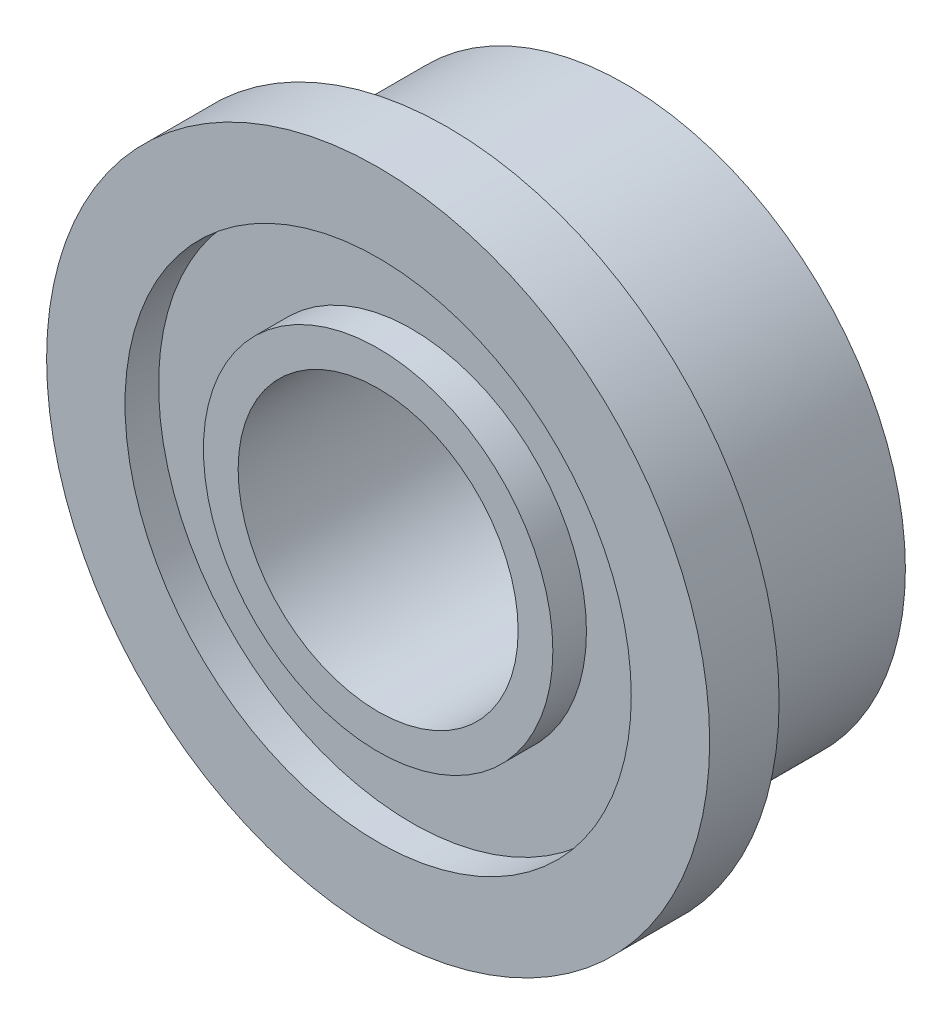
ISO-10303-21;
HEADER;
FILE_DESCRIPTION(('STEP AP214'),'2;1');
FILE_NAME('part.step','',(''),(''),'','','');
FILE_SCHEMA(('AUTOMOTIVE_DESIGN { 1 0 10303 214 1 1 1 1 }'));
ENDSEC;
DATA;
#1=APPLICATION_CONTEXT('core data for automotive mechanical design processes');
#2=APPLICATION_PROTOCOL_DEFINITION('international standard','automotive_design',2000,#1);
#3=PRODUCT_CONTEXT('',#1,'mechanical');
#4=PRODUCT('Part','Part','',(#3));
#5=PRODUCT_RELATED_PRODUCT_CATEGORY('part','',(#4));
#6=PRODUCT_DEFINITION_FORMATION('','',#4);
#7=PRODUCT_DEFINITION_CONTEXT('part definition',#1,'design');
#8=PRODUCT_DEFINITION('design','',#6,#7);
#9=PRODUCT_DEFINITION_SHAPE('','',#8);
#10=(LENGTH_UNIT() NAMED_UNIT(*) SI_UNIT(.MILLI.,.METRE.));
#11=(NAMED_UNIT(*) PLANE_ANGLE_UNIT() SI_UNIT($,.RADIAN.));
#12=(NAMED_UNIT(*) SI_UNIT($,.STERADIAN.) SOLID_ANGLE_UNIT());
#13=UNCERTAINTY_MEASURE_WITH_UNIT(LENGTH_MEASURE(1.E-05),#10,'distance_accuracy_value','');
#14=(GEOMETRIC_REPRESENTATION_CONTEXT(3) GLOBAL_UNCERTAINTY_ASSIGNED_CONTEXT((#13)) GLOBAL_UNIT_ASSIGNED_CONTEXT((#10,
#11,#12)) REPRESENTATION_CONTEXT('',''));
#15=CARTESIAN_POINT('',(0.,0.,0.));
#16=DIRECTION('',(0.,0.,1.));
#17=DIRECTION('',(1.,0.,0.));
#18=AXIS2_PLACEMENT_3D('',#15,#16,#17);
#19=CARTESIAN_POINT('',(0.,0.,2.803525));
#20=DIRECTION('',(0.,0.,1.));
#21=DIRECTION('',(1.,0.,0.));
#22=AXIS2_PLACEMENT_3D('',#19,#20,#21);
#23=PLANE('',#22);
#24=CARTESIAN_POINT('',(0.,0.,2.803525));
#25=DIRECTION('',(0.,0.,1.));
#26=DIRECTION('',(1.,0.,0.));
#27=AXIS2_PLACEMENT_3D('',#24,#25,#26);
#28=CIRCLE('',#27,1.5875);
#29=CARTESIAN_POINT('',(1.5875,0.,2.803525));
#30=VERTEX_POINT('',#29);
#31=EDGE_CURVE('E53',#30,#30,#28,.T.);
#32=ORIENTED_EDGE('',*,*,#31,.F.);
#33=EDGE_LOOP('',(#32));
#34=FACE_BOUND('',#33,.T.);
#35=CARTESIAN_POINT('',(0.,0.,2.803525));
#36=DIRECTION('',(0.,0.,1.));
#37=DIRECTION('',(1.,0.,0.));
#38=AXIS2_PLACEMENT_3D('',#35,#36,#37);
#39=CIRCLE('',#38,1.9812);
#40=CARTESIAN_POINT('',(1.9812,0.,2.803525));
#41=VERTEX_POINT('',#40);
#42=EDGE_CURVE('E65',#41,#41,#39,.T.);
#43=ORIENTED_EDGE('',*,*,#42,.T.);
#44=EDGE_LOOP('',(#43));
#45=FACE_BOUND('',#44,.T.);
#46=ADVANCED_FACE('F34',(#34,#45),#23,.T.);
#47=CARTESIAN_POINT('',(0.,0.,0.));
#48=DIRECTION('',(0.,0.,1.));
#49=DIRECTION('',(1.,0.,0.));
#50=AXIS2_PLACEMENT_3D('',#47,#48,#49);
#51=PLANE('',#50);
#52=CARTESIAN_POINT('',(0.,0.,0.));
#53=DIRECTION('',(0.,0.,1.));
#54=DIRECTION('',(1.,0.,0.));
#55=AXIS2_PLACEMENT_3D('',#52,#53,#54);
#56=CIRCLE('',#55,3.175);
#57=CARTESIAN_POINT('',(3.175,0.,0.));
#58=VERTEX_POINT('',#57);
#59=EDGE_CURVE('E38',#58,#58,#56,.T.);
#60=ORIENTED_EDGE('',*,*,#59,.F.);
#61=EDGE_LOOP('',(#60));
#62=FACE_BOUND('',#61,.T.);
#63=CARTESIAN_POINT('',(0.,0.,0.));
#64=DIRECTION('',(0.,0.,1.));
#65=DIRECTION('',(1.,0.,0.));
#66=AXIS2_PLACEMENT_3D('',#63,#64,#65);
#67=CIRCLE('',#66,1.5875);
#68=CARTESIAN_POINT('',(1.5875,0.,0.));
#69=VERTEX_POINT('',#68);
#70=EDGE_CURVE('E45',#69,#69,#67,.T.);
#71=ORIENTED_EDGE('',*,*,#70,.T.);
#72=EDGE_LOOP('',(#71));
#73=FACE_BOUND('',#72,.T.);
#74=ADVANCED_FACE('F108',(#62,#73),#51,.F.);
#75=CARTESIAN_POINT('',(0.,0.,2.016125));
#76=DIRECTION('',(0.,0.,-1.));
#77=DIRECTION('',(-1.,0.,0.));
#78=AXIS2_PLACEMENT_3D('',#75,#76,#77);
#79=CYLINDRICAL_SURFACE('',#78,3.175);
#80=CARTESIAN_POINT('',(0.,0.,2.016125));
#81=DIRECTION('',(0.,0.,1.));
#82=DIRECTION('',(1.,0.,0.));
#83=AXIS2_PLACEMENT_3D('',#80,#81,#82);
#84=CIRCLE('',#83,3.175);
#85=CARTESIAN_POINT('',(3.175,0.,2.016125));
#86=VERTEX_POINT('',#85);
#87=EDGE_CURVE('E10',#86,#86,#84,.T.);
#88=ORIENTED_EDGE('',*,*,#87,.F.);
#89=EDGE_LOOP('',(#88));
#90=FACE_BOUND('',#89,.T.);
#91=ORIENTED_EDGE('',*,*,#59,.T.);
#92=EDGE_LOOP('',(#91));
#93=FACE_BOUND('',#92,.T.);
#94=ADVANCED_FACE('F36',(#90,#93),#79,.T.);
#95=CARTESIAN_POINT('',(0.,0.,2.016125));
#96=DIRECTION('',(0.,0.,-1.));
#97=DIRECTION('',(-1.,0.,0.));
#98=AXIS2_PLACEMENT_3D('',#95,#96,#97);
#99=CYLINDRICAL_SURFACE('',#98,1.5875);
#100=ORIENTED_EDGE('',*,*,#70,.F.);
#101=EDGE_LOOP('',(#100));
#102=FACE_BOUND('',#101,.T.);
#103=ORIENTED_EDGE('',*,*,#31,.T.);
#104=EDGE_LOOP('',(#103));
#105=FACE_BOUND('',#104,.T.);
#106=ADVANCED_FACE('F100',(#102,#105),#99,.F.);
#107=CARTESIAN_POINT('',(0.,0.,2.016125));
#108=DIRECTION('',(0.,0.,1.));
#109=DIRECTION('',(1.,0.,0.));
#110=AXIS2_PLACEMENT_3D('',#107,#108,#109);
#111=PLANE('',#110);
#112=CARTESIAN_POINT('',(0.,0.,2.016125));
#113=DIRECTION('',(0.,0.,1.));
#114=DIRECTION('',(1.,0.,0.));
#115=AXIS2_PLACEMENT_3D('',#112,#113,#114);
#116=CIRCLE('',#115,3.7592);
#117=CARTESIAN_POINT('',(3.7592,0.,2.016125));
#118=VERTEX_POINT('',#117);
#119=EDGE_CURVE('E50',#118,#118,#116,.T.);
#120=ORIENTED_EDGE('',*,*,#119,.F.);
#121=EDGE_LOOP('',(#120));
#122=FACE_BOUND('',#121,.T.);
#123=ORIENTED_EDGE('',*,*,#87,.T.);
#124=EDGE_LOOP('',(#123));
#125=FACE_BOUND('',#124,.T.);
#126=ADVANCED_FACE('F90',(#122,#125),#111,.F.);
#127=CARTESIAN_POINT('',(0.,0.,2.803525));
#128=DIRECTION('',(0.,0.,1.));
#129=DIRECTION('',(1.,0.,0.));
#130=AXIS2_PLACEMENT_3D('',#127,#128,#129);
#131=CIRCLE('',#130,2.8702);
#132=CARTESIAN_POINT('',(2.8702,0.,2.803525));
#133=VERTEX_POINT('',#132);
#134=EDGE_CURVE('E59',#133,#133,#131,.T.);
#135=ORIENTED_EDGE('',*,*,#134,.F.);
#136=EDGE_LOOP('',(#135));
#137=FACE_BOUND('',#136,.T.);
#138=CARTESIAN_POINT('',(0.,0.,2.803525));
#139=DIRECTION('',(0.,0.,1.));
#140=DIRECTION('',(1.,0.,0.));
#141=AXIS2_PLACEMENT_3D('',#138,#139,#140);
#142=CIRCLE('',#141,3.7592);
#143=CARTESIAN_POINT('',(3.7592,0.,2.803525));
#144=VERTEX_POINT('',#143);
#145=EDGE_CURVE('E49',#144,#144,#142,.T.);
#146=ORIENTED_EDGE('',*,*,#145,.T.);
#147=EDGE_LOOP('',(#146));
#148=FACE_BOUND('',#147,.T.);
#149=ADVANCED_FACE('F87',(#137,#148),#23,.T.);
#150=CARTESIAN_POINT('',(0.,0.,2.803525));
#151=DIRECTION('',(0.,0.,-1.));
#152=DIRECTION('',(-1.,0.,0.));
#153=AXIS2_PLACEMENT_3D('',#150,#151,#152);
#154=CYLINDRICAL_SURFACE('',#153,3.7592);
#155=ORIENTED_EDGE('',*,*,#145,.F.);
#156=EDGE_LOOP('',(#155));
#157=FACE_BOUND('',#156,.T.);
#158=ORIENTED_EDGE('',*,*,#119,.T.);
#159=EDGE_LOOP('',(#158));
#160=FACE_BOUND('',#159,.T.);
#161=ADVANCED_FACE('F83',(#157,#160),#154,.T.);
#162=CARTESIAN_POINT('',(0.,0.,2.422525));
#163=DIRECTION('',(0.,0.,1.));
#164=DIRECTION('',(1.,0.,0.));
#165=AXIS2_PLACEMENT_3D('',#162,#163,#164);
#166=CYLINDRICAL_SURFACE('',#165,2.8702);
#167=CARTESIAN_POINT('',(0.,0.,2.422525));
#168=DIRECTION('',(0.,0.,1.));
#169=DIRECTION('',(1.,0.,0.));
#170=AXIS2_PLACEMENT_3D('',#167,#168,#169);
#171=CIRCLE('',#170,2.8702);
#172=CARTESIAN_POINT('',(2.8702,0.,2.422525));
#173=VERTEX_POINT('',#172);
#174=EDGE_CURVE('E58',#173,#173,#171,.T.);
#175=ORIENTED_EDGE('',*,*,#174,.F.);
#176=EDGE_LOOP('',(#175));
#177=FACE_BOUND('',#176,.T.);
#178=ORIENTED_EDGE('',*,*,#134,.T.);
#179=EDGE_LOOP('',(#178));
#180=FACE_BOUND('',#179,.T.);
#181=ADVANCED_FACE('F77',(#177,#180),#166,.F.);
#182=CARTESIAN_POINT('',(0.,0.,2.422525));
#183=DIRECTION('',(0.,0.,1.));
#184=DIRECTION('',(1.,0.,0.));
#185=AXIS2_PLACEMENT_3D('',#182,#183,#184);
#186=PLANE('',#185);
#187=CARTESIAN_POINT('',(0.,0.,2.422525));
#188=DIRECTION('',(0.,0.,1.));
#189=DIRECTION('',(1.,0.,0.));
#190=AXIS2_PLACEMENT_3D('',#187,#188,#189);
#191=CIRCLE('',#190,1.9812);
#192=CARTESIAN_POINT('',(1.9812,0.,2.422525));
#193=VERTEX_POINT('',#192);
#194=EDGE_CURVE('E62',#193,#193,#191,.T.);
#195=ORIENTED_EDGE('',*,*,#194,.F.);
#196=EDGE_LOOP('',(#195));
#197=FACE_BOUND('',#196,.T.);
#198=ORIENTED_EDGE('',*,*,#174,.T.);
#199=EDGE_LOOP('',(#198));
#200=FACE_BOUND('',#199,.T.);
#201=ADVANCED_FACE('F74',(#197,#200),#186,.T.);
#202=CARTESIAN_POINT('',(0.,0.,2.422525));
#203=DIRECTION('',(0.,0.,1.));
#204=DIRECTION('',(1.,0.,0.));
#205=AXIS2_PLACEMENT_3D('',#202,#203,#204);
#206=CYLINDRICAL_SURFACE('',#205,1.9812);
#207=ORIENTED_EDGE('',*,*,#194,.T.);
#208=EDGE_LOOP('',(#207));
#209=FACE_BOUND('',#208,.T.);
#210=ORIENTED_EDGE('',*,*,#42,.F.);
#211=EDGE_LOOP('',(#210));
#212=FACE_BOUND('',#211,.T.);
#213=ADVANCED_FACE('F71',(#209,#212),#206,.T.);
#214=CLOSED_SHELL('',(#46,#74,#94,#106,#126,#149,#161,#181,#201,#213));
#215=MANIFOLD_SOLID_BREP('B2',#214);
#216=ADVANCED_BREP_SHAPE_REPRESENTATION('',(#18,#215),#14);
#217=SHAPE_DEFINITION_REPRESENTATION(#9,#216);
ENDSEC;
END-ISO-10303-21;
